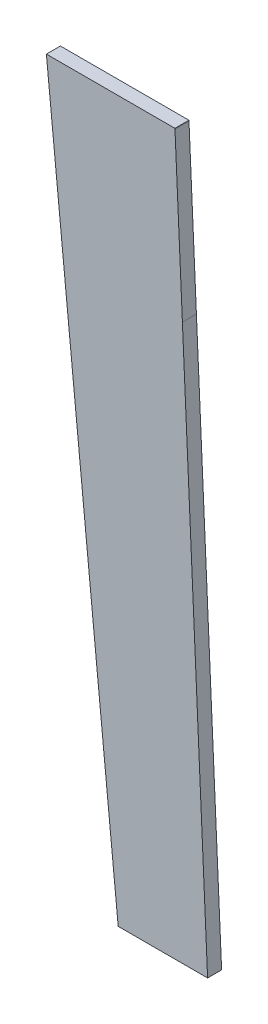
ISO-10303-21;
HEADER;
FILE_DESCRIPTION(('STEP AP214'),'2;1');
FILE_NAME('part.step','',(''),(''),'','','');
FILE_SCHEMA(('AUTOMOTIVE_DESIGN { 1 0 10303 214 1 1 1 1 }'));
ENDSEC;
DATA;
#1=APPLICATION_CONTEXT('core data for automotive mechanical design processes');
#2=APPLICATION_PROTOCOL_DEFINITION('international standard','automotive_design',2000,#1);
#3=PRODUCT_CONTEXT('',#1,'mechanical');
#4=PRODUCT('Part','Part','',(#3));
#5=PRODUCT_RELATED_PRODUCT_CATEGORY('part','',(#4));
#6=PRODUCT_DEFINITION_FORMATION('','',#4);
#7=PRODUCT_DEFINITION_CONTEXT('part definition',#1,'design');
#8=PRODUCT_DEFINITION('design','',#6,#7);
#9=PRODUCT_DEFINITION_SHAPE('','',#8);
#10=(LENGTH_UNIT() NAMED_UNIT(*) SI_UNIT(.MILLI.,.METRE.));
#11=(NAMED_UNIT(*) PLANE_ANGLE_UNIT() SI_UNIT($,.RADIAN.));
#12=(NAMED_UNIT(*) SI_UNIT($,.STERADIAN.) SOLID_ANGLE_UNIT());
#13=UNCERTAINTY_MEASURE_WITH_UNIT(LENGTH_MEASURE(1.E-05),#10,'distance_accuracy_value','');
#14=(GEOMETRIC_REPRESENTATION_CONTEXT(3) GLOBAL_UNCERTAINTY_ASSIGNED_CONTEXT((#13)) GLOBAL_UNIT_ASSIGNED_CONTEXT((#10,
#11,#12)) REPRESENTATION_CONTEXT('',''));
#15=CARTESIAN_POINT('',(0.,0.,0.));
#16=DIRECTION('',(0.,0.,1.));
#17=DIRECTION('',(1.,0.,0.));
#18=AXIS2_PLACEMENT_3D('',#15,#16,#17);
#19=CARTESIAN_POINT('',(-97.3287520201356,-11.7992249327933,5.90076729701178));
#20=DIRECTION('',(-0.995055569959869,-0.0993197497572395,0.));
#21=DIRECTION('',(-0.0993197497572395,0.995055569959869,0.));
#22=AXIS2_PLACEMENT_3D('',#19,#20,#21);
#23=PLANE('',#22);
#24=DIRECTION('',(-0.0993197497572395,0.995055569959869,0.));
#25=VECTOR('',#24,1.);
#26=CARTESIAN_POINT('',(-97.3287520201356,-11.7992249327933,0.635));
#27=LINE('',#26,#25);
#28=CARTESIAN_POINT('',(-97.3579733928344,-11.506464532791,0.635));
#29=VERTEX_POINT('',#28);
#30=CARTESIAN_POINT('',(-97.329324988223,-11.7934845327925,0.635));
#31=VERTEX_POINT('',#30);
#32=EDGE_CURVE('E77',#29,#31,#27,.F.);
#33=ORIENTED_EDGE('',*,*,#32,.T.);
#34=DIRECTION('',(0.,0.,-1.));
#35=VECTOR('',#34,1.);
#36=CARTESIAN_POINT('',(-97.3293249882182,-11.7934845327921,3.11150000000013));
#37=LINE('',#36,#35);
#38=CARTESIAN_POINT('',(-97.329324988223,-11.7934845327925,5.588));
#39=VERTEX_POINT('',#38);
#40=EDGE_CURVE('E92',#31,#39,#37,.F.);
#41=ORIENTED_EDGE('',*,*,#40,.T.);
#42=DIRECTION('',(-0.0993197497572395,0.995055569959869,0.));
#43=VECTOR('',#42,1.);
#44=CARTESIAN_POINT('',(-97.3436491905317,-11.649974532792,5.588));
#45=LINE('',#44,#43);
#46=CARTESIAN_POINT('',(-97.3579733928344,-11.5064645327909,5.588));
#47=VERTEX_POINT('',#46);
#48=EDGE_CURVE('E109',#47,#39,#45,.F.);
#49=ORIENTED_EDGE('',*,*,#48,.F.);
#50=DIRECTION('',(0.,0.,1.));
#51=VECTOR('',#50,1.);
#52=CARTESIAN_POINT('',(-97.3579733928332,-11.506464532791,3.11150000000013));
#53=LINE('',#52,#51);
#54=EDGE_CURVE('E90',#47,#29,#53,.F.);
#55=ORIENTED_EDGE('',*,*,#54,.T.);
#56=EDGE_LOOP('',(#33,#41,#49,#55));
#57=FACE_BOUND('',#56,.T.);
#58=ADVANCED_FACE('F17',(#57),#23,.T.);
#59=CARTESIAN_POINT('',(-51.927419160194,-11.5007241328034,5.90076729701178));
#60=DIRECTION('',(0.998970569791775,0.0453629881058949,0.));
#61=DIRECTION('',(0.0453629881058949,-0.998970569791775,0.));
#62=AXIS2_PLACEMENT_3D('',#59,#60,#61);
#63=PLANE('',#62);
#64=DIRECTION('',(0.0453629881058949,-0.998970569791775,0.));
#65=VECTOR('',#64,1.);
#66=CARTESIAN_POINT('',(-51.927419160194,-11.5007241328034,0.635));
#67=LINE('',#66,#65);
#68=CARTESIAN_POINT('',(-51.9141249882317,-11.7934845328035,0.635));
#69=VERTEX_POINT('',#68);
#70=CARTESIAN_POINT('',(-51.9271584901548,-11.5064645328032,0.635));
#71=VERTEX_POINT('',#70);
#72=EDGE_CURVE('E21',#69,#71,#67,.F.);
#73=ORIENTED_EDGE('',*,*,#72,.T.);
#74=DIRECTION('',(0.,0.,-1.));
#75=VECTOR('',#74,1.);
#76=CARTESIAN_POINT('',(-51.927158490154,-11.5064645328032,3.11150000000013));
#77=LINE('',#76,#75);
#78=CARTESIAN_POINT('',(-51.9271584901548,-11.5064645328035,5.588));
#79=VERTEX_POINT('',#78);
#80=EDGE_CURVE('E73',#71,#79,#77,.F.);
#81=ORIENTED_EDGE('',*,*,#80,.T.);
#82=DIRECTION('',(0.0453629881058949,-0.998970569791775,0.));
#83=VECTOR('',#82,1.);
#84=CARTESIAN_POINT('',(-51.9206417391921,-11.6499745328034,5.588));
#85=LINE('',#84,#83);
#86=CARTESIAN_POINT('',(-51.9141249882317,-11.7934845328035,5.588));
#87=VERTEX_POINT('',#86);
#88=EDGE_CURVE('E78',#87,#79,#85,.F.);
#89=ORIENTED_EDGE('',*,*,#88,.F.);
#90=DIRECTION('',(0.,0.,1.));
#91=VECTOR('',#90,1.);
#92=CARTESIAN_POINT('',(-51.9141249882347,-11.7934845328036,3.11150000000013));
#93=LINE('',#92,#91);
#94=EDGE_CURVE('E76',#87,#69,#93,.F.);
#95=ORIENTED_EDGE('',*,*,#94,.T.);
#96=EDGE_LOOP('',(#73,#81,#89,#95));
#97=FACE_BOUND('',#96,.T.);
#98=ADVANCED_FACE('F72',(#97),#63,.T.);
#99=CARTESIAN_POINT('',(-39.2404940622382,-270.879224935158,0.635));
#100=DIRECTION('',(0.,0.,-1.));
#101=DIRECTION('',(-1.,0.,0.));
#102=AXIS2_PLACEMENT_3D('',#99,#100,#101);
#103=PLANE('',#102);
#104=DIRECTION('',(-1.,2.68828998519524E-13,0.));
#105=VECTOR('',#104,1.);
#106=CARTESIAN_POINT('',(-74.6425659414936,-11.5064645327971,0.635));
#107=LINE('',#106,#105);
#108=EDGE_CURVE('E83',#29,#71,#107,.F.);
#109=ORIENTED_EDGE('',*,*,#108,.T.);
#110=ORIENTED_EDGE('',*,*,#72,.F.);
#111=DIRECTION('',(-0.0453629881296856,0.998970569790695,0.));
#112=VECTOR('',#111,1.);
#113=CARTESIAN_POINT('',(-50.6033581058195,-40.6588127083994,0.635));
#114=LINE('',#113,#112);
#115=CARTESIAN_POINT('',(-49.2925912233966,-69.5241408839782,0.635));
#116=VERTEX_POINT('',#115);
#117=EDGE_CURVE('E104',#69,#116,#114,.F.);
#118=ORIENTED_EDGE('',*,*,#117,.T.);
#119=DIRECTION('',(-0.0453629881297617,0.998970569790692,0.));
#120=VECTOR('',#119,1.);
#121=CARTESIAN_POINT('',(-44.836321851942,-167.658812709492,0.635));
#122=LINE('',#121,#120);
#123=CARTESIAN_POINT('',(-40.3800524804925,-265.793484535158,0.635));
#124=VERTEX_POINT('',#123);
#125=EDGE_CURVE('E103',#116,#124,#122,.F.);
#126=ORIENTED_EDGE('',*,*,#125,.T.);
#127=DIRECTION('',(1.,0.,0.));
#128=VECTOR('',#127,1.);
#129=CARTESIAN_POINT('',(-56.1784035113706,-265.793484535158,0.635));
#130=LINE('',#129,#128);
#131=CARTESIAN_POINT('',(-71.9767545422362,-265.793484535158,0.635));
#132=VERTEX_POINT('',#131);
#133=EDGE_CURVE('E105',#124,#132,#130,.F.);
#134=ORIENTED_EDGE('',*,*,#133,.T.);
#135=DIRECTION('',(0.0993197497436499,-0.995055569961225,0.));
#136=VECTOR('',#135,1.);
#137=CARTESIAN_POINT('',(-84.6530397652227,-138.793484533953,0.635));
#138=LINE('',#137,#136);
#139=EDGE_CURVE('E98',#132,#31,#138,.F.);
#140=ORIENTED_EDGE('',*,*,#139,.T.);
#141=ORIENTED_EDGE('',*,*,#32,.F.);
#142=EDGE_LOOP('',(#109,#110,#118,#126,#134,#140,#141));
#143=FACE_BOUND('',#142,.T.);
#144=ADVANCED_FACE('F88',(#143),#103,.T.);
#145=CARTESIAN_POINT('',(-71.4697031333076,-270.873484535158,5.90076729701178));
#146=DIRECTION('',(-0.995055569961225,-0.0993197497436499,0.));
#147=DIRECTION('',(-0.0993197497436499,0.995055569961225,0.));
#148=AXIS2_PLACEMENT_3D('',#145,#146,#147);
#149=PLANE('',#148);
#150=ORIENTED_EDGE('',*,*,#139,.F.);
#151=DIRECTION('',(0.,0.,-1.));
#152=VECTOR('',#151,1.);
#153=CARTESIAN_POINT('',(-71.9767545422406,-265.793484535158,3.11150000000013));
#154=LINE('',#153,#152);
#155=CARTESIAN_POINT('',(-71.9767545422317,-265.793484535158,5.588));
#156=VERTEX_POINT('',#155);
#157=EDGE_CURVE('E110',#132,#156,#154,.F.);
#158=ORIENTED_EDGE('',*,*,#157,.T.);
#159=DIRECTION('',(-0.0993197497436499,0.995055569961225,0.));
#160=VECTOR('',#159,1.);
#161=CARTESIAN_POINT('',(-71.4697031333076,-270.873484535158,5.588));
#162=LINE('',#161,#160);
#163=EDGE_CURVE('E113',#156,#39,#162,.T.);
#164=ORIENTED_EDGE('',*,*,#163,.T.);
#165=ORIENTED_EDGE('',*,*,#40,.F.);
#166=EDGE_LOOP('',(#150,#158,#164,#165));
#167=FACE_BOUND('',#166,.T.);
#168=ADVANCED_FACE('F126',(#167),#149,.T.);
#169=CARTESIAN_POINT('',(-98.2665896908878,-11.5064645327907,5.90076729701178));
#170=DIRECTION('',(2.68828998519524E-13,1.,0.));
#171=DIRECTION('',(1.,-2.68828998519524E-13,0.));
#172=AXIS2_PLACEMENT_3D('',#169,#170,#171);
#173=PLANE('',#172);
#174=ORIENTED_EDGE('',*,*,#108,.F.);
#175=ORIENTED_EDGE('',*,*,#54,.F.);
#176=DIRECTION('',(1.,-2.5222957536884E-13,0.));
#177=VECTOR('',#176,1.);
#178=CARTESIAN_POINT('',(-68.86901293663,-11.506464532798,5.588));
#179=LINE('',#178,#177);
#180=EDGE_CURVE('E86',#47,#79,#179,.T.);
#181=ORIENTED_EDGE('',*,*,#180,.T.);
#182=ORIENTED_EDGE('',*,*,#80,.F.);
#183=EDGE_LOOP('',(#174,#175,#181,#182));
#184=FACE_BOUND('',#183,.T.);
#185=ADVANCED_FACE('F81',(#184),#173,.T.);
#186=CARTESIAN_POINT('',(-51.9665556635312,-10.6388714057808,5.90076729701178));
#187=DIRECTION('',(0.998970569790695,0.0453629881296857,0.));
#188=DIRECTION('',(0.0453629881296857,-0.998970569790695,0.));
#189=AXIS2_PLACEMENT_3D('',#186,#187,#188);
#190=PLANE('',#189);
#191=ORIENTED_EDGE('',*,*,#117,.F.);
#192=ORIENTED_EDGE('',*,*,#94,.F.);
#193=DIRECTION('',(0.0453629881296857,-0.998970569790695,0.));
#194=VECTOR('',#193,1.);
#195=CARTESIAN_POINT('',(-51.9665556635312,-10.6388714057808,5.588));
#196=LINE('',#195,#194);
#197=CARTESIAN_POINT('',(-49.2925912233957,-69.5241408839781,5.588));
#198=VERTEX_POINT('',#197);
#199=EDGE_CURVE('E117',#87,#198,#196,.T.);
#200=ORIENTED_EDGE('',*,*,#199,.T.);
#201=DIRECTION('',(0.,0.,1.));
#202=VECTOR('',#201,1.);
#203=CARTESIAN_POINT('',(-49.2925912233926,-69.524140883978,3.11150000000013));
#204=LINE('',#203,#202);
#205=EDGE_CURVE('E100',#198,#116,#204,.F.);
#206=ORIENTED_EDGE('',*,*,#205,.T.);
#207=EDGE_LOOP('',(#191,#192,#200,#206));
#208=FACE_BOUND('',#207,.T.);
#209=ADVANCED_FACE('F140',(#208),#190,.T.);
#210=CARTESIAN_POINT('',(-49.4708419982502,-65.5987540109672,5.90076729701178));
#211=DIRECTION('',(0.998970569790692,0.0453629881297617,0.));
#212=DIRECTION('',(0.0453629881297617,-0.998970569790692,0.));
#213=AXIS2_PLACEMENT_3D('',#210,#211,#212);
#214=PLANE('',#213);
#215=ORIENTED_EDGE('',*,*,#125,.F.);
#216=ORIENTED_EDGE('',*,*,#205,.F.);
#217=DIRECTION('',(0.0453629881297617,-0.998970569790692,0.));
#218=VECTOR('',#217,1.);
#219=CARTESIAN_POINT('',(-49.4708419982502,-65.5987540109672,5.588));
#220=LINE('',#219,#218);
#221=CARTESIAN_POINT('',(-40.3800524804925,-265.793484535158,5.588));
#222=VERTEX_POINT('',#221);
#223=EDGE_CURVE('E27',#198,#222,#220,.T.);
#224=ORIENTED_EDGE('',*,*,#223,.T.);
#225=DIRECTION('',(0.,0.,1.));
#226=VECTOR('',#225,1.);
#227=CARTESIAN_POINT('',(-40.3800524805006,-265.793484535158,3.11150000000013));
#228=LINE('',#227,#226);
#229=EDGE_CURVE('E35',#222,#124,#228,.F.);
#230=ORIENTED_EDGE('',*,*,#229,.T.);
#231=EDGE_LOOP('',(#215,#216,#224,#230));
#232=FACE_BOUND('',#231,.T.);
#233=ADVANCED_FACE('F138',(#232),#214,.T.);
#234=CARTESIAN_POINT('',(-39.7481184392658,-265.793484535158,5.90076729701178));
#235=DIRECTION('',(0.,-1.,0.));
#236=DIRECTION('',(-1.,0.,0.));
#237=AXIS2_PLACEMENT_3D('',#234,#235,#236);
#238=PLANE('',#237);
#239=ORIENTED_EDGE('',*,*,#133,.F.);
#240=ORIENTED_EDGE('',*,*,#229,.F.);
#241=DIRECTION('',(-1.,0.,0.));
#242=VECTOR('',#241,1.);
#243=CARTESIAN_POINT('',(-68.8690129366911,-265.793484535158,5.588));
#244=LINE('',#243,#242);
#245=EDGE_CURVE('E11',#222,#156,#244,.T.);
#246=ORIENTED_EDGE('',*,*,#245,.T.);
#247=ORIENTED_EDGE('',*,*,#157,.F.);
#248=EDGE_LOOP('',(#239,#240,#246,#247));
#249=FACE_BOUND('',#248,.T.);
#250=ADVANCED_FACE('F143',(#249),#238,.T.);
#251=CARTESIAN_POINT('',(-39.2404940622382,-270.879224935158,5.588));
#252=DIRECTION('',(0.,0.,-1.));
#253=DIRECTION('',(-1.,0.,0.));
#254=AXIS2_PLACEMENT_3D('',#251,#252,#253);
#255=PLANE('',#254);
#256=ORIENTED_EDGE('',*,*,#223,.F.);
#257=ORIENTED_EDGE('',*,*,#199,.F.);
#258=ORIENTED_EDGE('',*,*,#88,.T.);
#259=ORIENTED_EDGE('',*,*,#180,.F.);
#260=ORIENTED_EDGE('',*,*,#48,.T.);
#261=ORIENTED_EDGE('',*,*,#163,.F.);
#262=ORIENTED_EDGE('',*,*,#245,.F.);
#263=EDGE_LOOP('',(#256,#257,#258,#259,#260,#261,#262));
#264=FACE_BOUND('',#263,.T.);
#265=ADVANCED_FACE('F19',(#264),#255,.F.);
#266=CLOSED_SHELL('',(#58,#98,#144,#168,#185,#209,#233,#250,#265));
#267=MANIFOLD_SOLID_BREP('B1',#266);
#268=ADVANCED_BREP_SHAPE_REPRESENTATION('',(#18,#267),#14);
#269=SHAPE_DEFINITION_REPRESENTATION(#9,#268);
ENDSEC;
END-ISO-10303-21;
